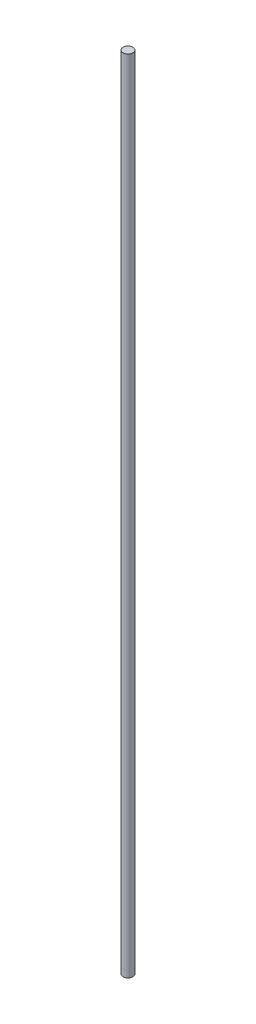
ISO-10303-21;
HEADER;
FILE_DESCRIPTION(('STEP AP214'),'2;1');
FILE_NAME('part.step','',(''),(''),'','','');
FILE_SCHEMA(('AUTOMOTIVE_DESIGN { 1 0 10303 214 1 1 1 1 }'));
ENDSEC;
DATA;
#1=APPLICATION_CONTEXT('core data for automotive mechanical design processes');
#2=APPLICATION_PROTOCOL_DEFINITION('international standard','automotive_design',2000,#1);
#3=PRODUCT_CONTEXT('',#1,'mechanical');
#4=PRODUCT('Part','Part','',(#3));
#5=PRODUCT_RELATED_PRODUCT_CATEGORY('part','',(#4));
#6=PRODUCT_DEFINITION_FORMATION('','',#4);
#7=PRODUCT_DEFINITION_CONTEXT('part definition',#1,'design');
#8=PRODUCT_DEFINITION('design','',#6,#7);
#9=PRODUCT_DEFINITION_SHAPE('','',#8);
#10=(LENGTH_UNIT() NAMED_UNIT(*) SI_UNIT(.MILLI.,.METRE.));
#11=(NAMED_UNIT(*) PLANE_ANGLE_UNIT() SI_UNIT($,.RADIAN.));
#12=(NAMED_UNIT(*) SI_UNIT($,.STERADIAN.) SOLID_ANGLE_UNIT());
#13=UNCERTAINTY_MEASURE_WITH_UNIT(LENGTH_MEASURE(1.E-05),#10,'distance_accuracy_value','');
#14=(GEOMETRIC_REPRESENTATION_CONTEXT(3) GLOBAL_UNCERTAINTY_ASSIGNED_CONTEXT((#13)) GLOBAL_UNIT_ASSIGNED_CONTEXT((#10,
#11,#12)) REPRESENTATION_CONTEXT('',''));
#15=CARTESIAN_POINT('',(0.,0.,0.));
#16=DIRECTION('',(0.,0.,1.));
#17=DIRECTION('',(1.,0.,0.));
#18=AXIS2_PLACEMENT_3D('',#15,#16,#17);
#19=CARTESIAN_POINT('',(0.,650.,0.));
#20=DIRECTION('',(0.,-1.,0.));
#21=DIRECTION('',(0.,0.,-1.));
#22=AXIS2_PLACEMENT_3D('',#19,#20,#21);
#23=CYLINDRICAL_SURFACE('',#22,4.);
#24=CARTESIAN_POINT('',(0.,650.,0.));
#25=DIRECTION('',(0.,1.,0.));
#26=DIRECTION('',(0.,0.,1.));
#27=AXIS2_PLACEMENT_3D('',#24,#25,#26);
#28=CIRCLE('',#27,4.);
#29=CARTESIAN_POINT('',(0.,650.,4.));
#30=VERTEX_POINT('',#29);
#31=EDGE_CURVE('E10',#30,#30,#28,.T.);
#32=ORIENTED_EDGE('',*,*,#31,.F.);
#33=EDGE_LOOP('',(#32));
#34=FACE_BOUND('',#33,.T.);
#35=CARTESIAN_POINT('',(0.,0.,0.));
#36=DIRECTION('',(0.,1.,0.));
#37=DIRECTION('',(0.,0.,1.));
#38=AXIS2_PLACEMENT_3D('',#35,#36,#37);
#39=CIRCLE('',#38,4.);
#40=CARTESIAN_POINT('',(0.,0.,4.));
#41=VERTEX_POINT('',#40);
#42=EDGE_CURVE('E34',#41,#41,#39,.T.);
#43=ORIENTED_EDGE('',*,*,#42,.T.);
#44=EDGE_LOOP('',(#43));
#45=FACE_BOUND('',#44,.T.);
#46=ADVANCED_FACE('F31',(#34,#45),#23,.T.);
#47=CARTESIAN_POINT('',(0.,650.,0.));
#48=DIRECTION('',(0.,1.,0.));
#49=DIRECTION('',(0.,0.,1.));
#50=AXIS2_PLACEMENT_3D('',#47,#48,#49);
#51=PLANE('',#50);
#52=ORIENTED_EDGE('',*,*,#31,.T.);
#53=EDGE_LOOP('',(#52));
#54=FACE_BOUND('',#53,.T.);
#55=ADVANCED_FACE('F46',(#54),#51,.T.);
#56=CARTESIAN_POINT('',(0.,0.,0.));
#57=DIRECTION('',(0.,1.,0.));
#58=DIRECTION('',(0.,0.,1.));
#59=AXIS2_PLACEMENT_3D('',#56,#57,#58);
#60=PLANE('',#59);
#61=ORIENTED_EDGE('',*,*,#42,.F.);
#62=EDGE_LOOP('',(#61));
#63=FACE_BOUND('',#62,.T.);
#64=ADVANCED_FACE('F44',(#63),#60,.F.);
#65=CLOSED_SHELL('',(#46,#55,#64));
#66=MANIFOLD_SOLID_BREP('B2',#65);
#67=ADVANCED_BREP_SHAPE_REPRESENTATION('',(#18,#66),#14);
#68=SHAPE_DEFINITION_REPRESENTATION(#9,#67);
ENDSEC;
END-ISO-10303-21;
